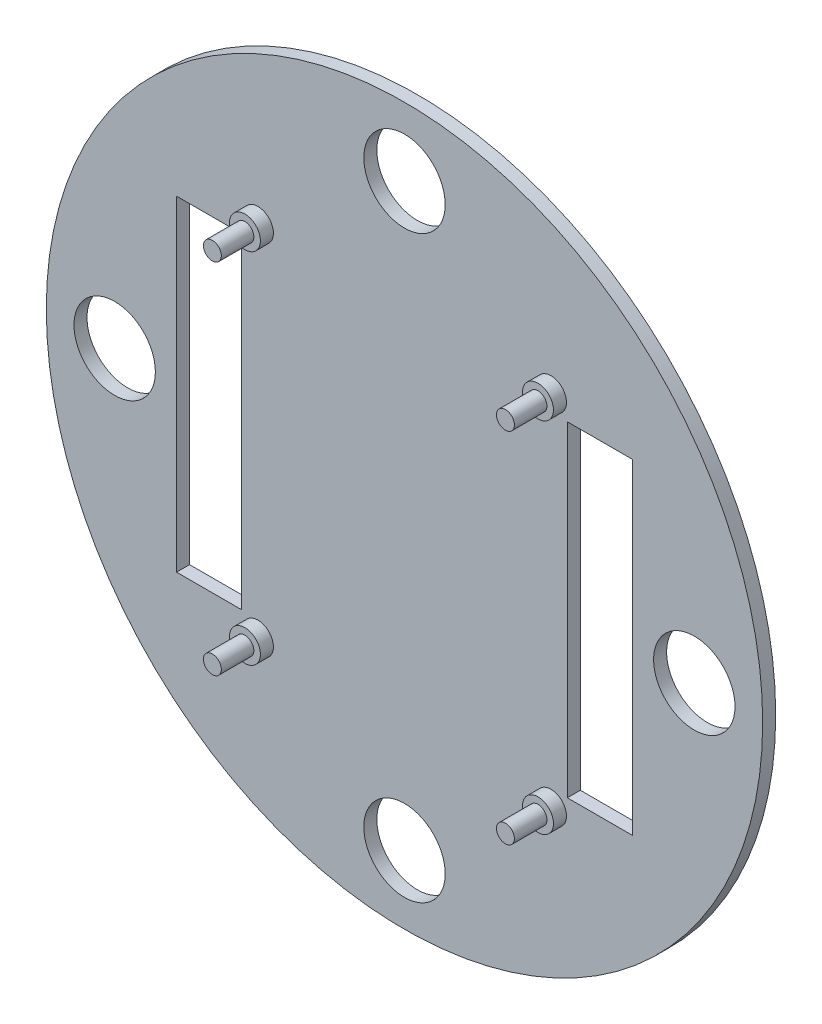
ISO-10303-21;
HEADER;
FILE_DESCRIPTION(('STEP AP214'),'2;1');
FILE_NAME('part.step','',(''),(''),'','','');
FILE_SCHEMA(('AUTOMOTIVE_DESIGN { 1 0 10303 214 1 1 1 1 }'));
ENDSEC;
DATA;
#1=APPLICATION_CONTEXT('core data for automotive mechanical design processes');
#2=APPLICATION_PROTOCOL_DEFINITION('international standard','automotive_design',2000,#1);
#3=PRODUCT_CONTEXT('',#1,'mechanical');
#4=PRODUCT('Part','Part','',(#3));
#5=PRODUCT_RELATED_PRODUCT_CATEGORY('part','',(#4));
#6=PRODUCT_DEFINITION_FORMATION('','',#4);
#7=PRODUCT_DEFINITION_CONTEXT('part definition',#1,'design');
#8=PRODUCT_DEFINITION('design','',#6,#7);
#9=PRODUCT_DEFINITION_SHAPE('','',#8);
#10=(LENGTH_UNIT() NAMED_UNIT(*) SI_UNIT(.MILLI.,.METRE.));
#11=(NAMED_UNIT(*) PLANE_ANGLE_UNIT() SI_UNIT($,.RADIAN.));
#12=(NAMED_UNIT(*) SI_UNIT($,.STERADIAN.) SOLID_ANGLE_UNIT());
#13=UNCERTAINTY_MEASURE_WITH_UNIT(LENGTH_MEASURE(1.E-05),#10,'distance_accuracy_value','');
#14=(GEOMETRIC_REPRESENTATION_CONTEXT(3) GLOBAL_UNCERTAINTY_ASSIGNED_CONTEXT((#13)) GLOBAL_UNIT_ASSIGNED_CONTEXT((#10,
#11,#12)) REPRESENTATION_CONTEXT('',''));
#15=CARTESIAN_POINT('',(0.,0.,0.));
#16=DIRECTION('',(0.,0.,1.));
#17=DIRECTION('',(1.,0.,0.));
#18=AXIS2_PLACEMENT_3D('',#15,#16,#17);
#19=CARTESIAN_POINT('',(0.,0.,0.));
#20=DIRECTION('',(0.,0.,1.));
#21=DIRECTION('',(1.,0.,0.));
#22=AXIS2_PLACEMENT_3D('',#19,#20,#21);
#23=PLANE('',#22);
#24=DIRECTION('',(-1.,0.,0.));
#25=VECTOR('',#24,1.);
#26=CARTESIAN_POINT('',(0.,25.,0.));
#27=LINE('',#26,#25);
#28=CARTESIAN_POINT('',(35.,25.,0.));
#29=VERTEX_POINT('',#28);
#30=CARTESIAN_POINT('',(25.,25.,0.));
#31=VERTEX_POINT('',#30);
#32=EDGE_CURVE('E243',#29,#31,#27,.T.);
#33=ORIENTED_EDGE('',*,*,#32,.T.);
#34=DIRECTION('',(0.,-1.,0.));
#35=VECTOR('',#34,1.);
#36=CARTESIAN_POINT('',(25.,0.,0.));
#37=LINE('',#36,#35);
#38=CARTESIAN_POINT('',(25.,-25.,0.));
#39=VERTEX_POINT('',#38);
#40=EDGE_CURVE('E247',#31,#39,#37,.T.);
#41=ORIENTED_EDGE('',*,*,#40,.T.);
#42=DIRECTION('',(1.,0.,0.));
#43=VECTOR('',#42,1.);
#44=CARTESIAN_POINT('',(0.,-25.,0.));
#45=LINE('',#44,#43);
#46=CARTESIAN_POINT('',(35.,-25.,0.));
#47=VERTEX_POINT('',#46);
#48=EDGE_CURVE('E238',#39,#47,#45,.T.);
#49=ORIENTED_EDGE('',*,*,#48,.T.);
#50=DIRECTION('',(0.,1.,0.));
#51=VECTOR('',#50,1.);
#52=CARTESIAN_POINT('',(35.,0.,0.));
#53=LINE('',#52,#51);
#54=EDGE_CURVE('E163',#47,#29,#53,.T.);
#55=ORIENTED_EDGE('',*,*,#54,.T.);
#56=EDGE_LOOP('',(#33,#41,#49,#55));
#57=FACE_BOUND('',#56,.T.);
#58=DIRECTION('',(-1.,0.,0.));
#59=VECTOR('',#58,1.);
#60=CARTESIAN_POINT('',(0.,25.,0.));
#61=LINE('',#60,#59);
#62=CARTESIAN_POINT('',(-25.,25.,0.));
#63=VERTEX_POINT('',#62);
#64=CARTESIAN_POINT('',(-35.,25.,0.));
#65=VERTEX_POINT('',#64);
#66=EDGE_CURVE('E230',#63,#65,#61,.T.);
#67=ORIENTED_EDGE('',*,*,#66,.T.);
#68=DIRECTION('',(0.,-1.,0.));
#69=VECTOR('',#68,1.);
#70=CARTESIAN_POINT('',(-35.,0.,0.));
#71=LINE('',#70,#69);
#72=CARTESIAN_POINT('',(-35.,-25.,0.));
#73=VERTEX_POINT('',#72);
#74=EDGE_CURVE('E234',#65,#73,#71,.T.);
#75=ORIENTED_EDGE('',*,*,#74,.T.);
#76=DIRECTION('',(1.,0.,0.));
#77=VECTOR('',#76,1.);
#78=CARTESIAN_POINT('',(0.,-25.,0.));
#79=LINE('',#78,#77);
#80=CARTESIAN_POINT('',(-25.,-25.,0.));
#81=VERTEX_POINT('',#80);
#82=EDGE_CURVE('E192',#73,#81,#79,.T.);
#83=ORIENTED_EDGE('',*,*,#82,.T.);
#84=DIRECTION('',(0.,1.,0.));
#85=VECTOR('',#84,1.);
#86=CARTESIAN_POINT('',(-25.,0.,0.));
#87=LINE('',#86,#85);
#88=EDGE_CURVE('E226',#81,#63,#87,.T.);
#89=ORIENTED_EDGE('',*,*,#88,.T.);
#90=EDGE_LOOP('',(#67,#75,#83,#89));
#91=FACE_BOUND('',#90,.T.);
#92=CARTESIAN_POINT('',(44.5,0.,0.));
#93=DIRECTION('',(0.,0.,1.));
#94=DIRECTION('',(1.,0.,0.));
#95=AXIS2_PLACEMENT_3D('',#92,#93,#94);
#96=CIRCLE('',#95,6.25);
#97=CARTESIAN_POINT('',(50.75,0.,0.));
#98=VERTEX_POINT('',#97);
#99=EDGE_CURVE('E252',#98,#98,#96,.T.);
#100=ORIENTED_EDGE('',*,*,#99,.T.);
#101=EDGE_LOOP('',(#100));
#102=FACE_BOUND('',#101,.T.);
#103=CARTESIAN_POINT('',(0.,44.5,0.));
#104=DIRECTION('',(0.,0.,1.));
#105=DIRECTION('',(1.,0.,0.));
#106=AXIS2_PLACEMENT_3D('',#103,#104,#105);
#107=CIRCLE('',#106,6.25);
#108=CARTESIAN_POINT('',(6.25,44.5,0.));
#109=VERTEX_POINT('',#108);
#110=EDGE_CURVE('E265',#109,#109,#107,.T.);
#111=ORIENTED_EDGE('',*,*,#110,.T.);
#112=EDGE_LOOP('',(#111));
#113=FACE_BOUND('',#112,.T.);
#114=CARTESIAN_POINT('',(-44.5,0.,0.));
#115=DIRECTION('',(0.,0.,1.));
#116=DIRECTION('',(1.,0.,0.));
#117=AXIS2_PLACEMENT_3D('',#114,#115,#116);
#118=CIRCLE('',#117,6.25);
#119=CARTESIAN_POINT('',(-38.25,0.,0.));
#120=VERTEX_POINT('',#119);
#121=EDGE_CURVE('E273',#120,#120,#118,.T.);
#122=ORIENTED_EDGE('',*,*,#121,.T.);
#123=EDGE_LOOP('',(#122));
#124=FACE_BOUND('',#123,.T.);
#125=CARTESIAN_POINT('',(0.,-44.5,0.));
#126=DIRECTION('',(0.,0.,1.));
#127=DIRECTION('',(1.,0.,0.));
#128=AXIS2_PLACEMENT_3D('',#125,#126,#127);
#129=CIRCLE('',#128,6.25);
#130=CARTESIAN_POINT('',(6.25,-44.5,0.));
#131=VERTEX_POINT('',#130);
#132=EDGE_CURVE('E251',#131,#131,#129,.T.);
#133=ORIENTED_EDGE('',*,*,#132,.T.);
#134=EDGE_LOOP('',(#133));
#135=FACE_BOUND('',#134,.T.);
#136=CARTESIAN_POINT('',(0.,0.,0.));
#137=DIRECTION('',(0.,0.,1.));
#138=DIRECTION('',(1.,0.,0.));
#139=AXIS2_PLACEMENT_3D('',#136,#137,#138);
#140=CIRCLE('',#139,55.);
#141=CARTESIAN_POINT('',(55.,0.,0.));
#142=VERTEX_POINT('',#141);
#143=EDGE_CURVE('E287',#142,#142,#140,.F.);
#144=ORIENTED_EDGE('',*,*,#143,.T.);
#145=EDGE_LOOP('',(#144));
#146=FACE_BOUND('',#145,.T.);
#147=ADVANCED_FACE('F91',(#57,#91,#102,#113,#124,#135,#146),#23,.F.);
#148=CARTESIAN_POINT('',(0.,0.,2.));
#149=DIRECTION('',(0.,0.,1.));
#150=DIRECTION('',(1.,0.,0.));
#151=AXIS2_PLACEMENT_3D('',#148,#149,#150);
#152=PLANE('',#151);
#153=DIRECTION('',(0.,-1.,0.));
#154=VECTOR('',#153,1.);
#155=CARTESIAN_POINT('',(25.,25.,2.));
#156=LINE('',#155,#154);
#157=CARTESIAN_POINT('',(25.,25.,2.));
#158=VERTEX_POINT('',#157);
#159=CARTESIAN_POINT('',(25.,-25.,2.));
#160=VERTEX_POINT('',#159);
#161=EDGE_CURVE('E177',#158,#160,#156,.T.);
#162=ORIENTED_EDGE('',*,*,#161,.F.);
#163=DIRECTION('',(-1.,0.,0.));
#164=VECTOR('',#163,1.);
#165=CARTESIAN_POINT('',(25.,25.,2.));
#166=LINE('',#165,#164);
#167=CARTESIAN_POINT('',(35.,25.,2.));
#168=VERTEX_POINT('',#167);
#169=EDGE_CURVE('E182',#168,#158,#166,.T.);
#170=ORIENTED_EDGE('',*,*,#169,.F.);
#171=DIRECTION('',(0.,1.,0.));
#172=VECTOR('',#171,1.);
#173=CARTESIAN_POINT('',(35.,25.,2.));
#174=LINE('',#173,#172);
#175=CARTESIAN_POINT('',(35.,-25.,2.));
#176=VERTEX_POINT('',#175);
#177=EDGE_CURVE('E160',#176,#168,#174,.T.);
#178=ORIENTED_EDGE('',*,*,#177,.F.);
#179=DIRECTION('',(1.,0.,0.));
#180=VECTOR('',#179,1.);
#181=CARTESIAN_POINT('',(25.,-25.,2.));
#182=LINE('',#181,#180);
#183=EDGE_CURVE('E171',#160,#176,#182,.T.);
#184=ORIENTED_EDGE('',*,*,#183,.F.);
#185=EDGE_LOOP('',(#162,#170,#178,#184));
#186=FACE_BOUND('',#185,.T.);
#187=DIRECTION('',(0.,-1.,0.));
#188=VECTOR('',#187,1.);
#189=CARTESIAN_POINT('',(-35.,25.,2.));
#190=LINE('',#189,#188);
#191=CARTESIAN_POINT('',(-35.,25.,2.));
#192=VERTEX_POINT('',#191);
#193=CARTESIAN_POINT('',(-35.,-25.,2.));
#194=VERTEX_POINT('',#193);
#195=EDGE_CURVE('E197',#192,#194,#190,.T.);
#196=ORIENTED_EDGE('',*,*,#195,.F.);
#197=DIRECTION('',(-1.,0.,0.));
#198=VECTOR('',#197,1.);
#199=CARTESIAN_POINT('',(-35.,25.,2.));
#200=LINE('',#199,#198);
#201=CARTESIAN_POINT('',(-25.,25.,2.));
#202=VERTEX_POINT('',#201);
#203=EDGE_CURVE('E207',#202,#192,#200,.T.);
#204=ORIENTED_EDGE('',*,*,#203,.F.);
#205=DIRECTION('',(0.,1.,0.));
#206=VECTOR('',#205,1.);
#207=CARTESIAN_POINT('',(-25.,25.,2.));
#208=LINE('',#207,#206);
#209=CARTESIAN_POINT('',(-25.,-25.,2.));
#210=VERTEX_POINT('',#209);
#211=EDGE_CURVE('E203',#210,#202,#208,.T.);
#212=ORIENTED_EDGE('',*,*,#211,.F.);
#213=DIRECTION('',(1.,0.,0.));
#214=VECTOR('',#213,1.);
#215=CARTESIAN_POINT('',(-35.,-25.,2.));
#216=LINE('',#215,#214);
#217=EDGE_CURVE('E200',#194,#210,#216,.T.);
#218=ORIENTED_EDGE('',*,*,#217,.F.);
#219=EDGE_LOOP('',(#196,#204,#212,#218));
#220=FACE_BOUND('',#219,.T.);
#221=CARTESIAN_POINT('',(44.5,0.,2.));
#222=DIRECTION('',(0.,0.,1.));
#223=DIRECTION('',(1.,0.,0.));
#224=AXIS2_PLACEMENT_3D('',#221,#222,#223);
#225=CIRCLE('',#224,6.25);
#226=CARTESIAN_POINT('',(50.75,0.,2.));
#227=VERTEX_POINT('',#226);
#228=EDGE_CURVE('E257',#227,#227,#225,.T.);
#229=ORIENTED_EDGE('',*,*,#228,.F.);
#230=EDGE_LOOP('',(#229));
#231=FACE_BOUND('',#230,.T.);
#232=CARTESIAN_POINT('',(0.,44.5,2.));
#233=DIRECTION('',(0.,0.,1.));
#234=DIRECTION('',(1.,0.,0.));
#235=AXIS2_PLACEMENT_3D('',#232,#233,#234);
#236=CIRCLE('',#235,6.25);
#237=CARTESIAN_POINT('',(6.25,44.5,2.));
#238=VERTEX_POINT('',#237);
#239=EDGE_CURVE('E261',#238,#238,#236,.T.);
#240=ORIENTED_EDGE('',*,*,#239,.F.);
#241=EDGE_LOOP('',(#240));
#242=FACE_BOUND('',#241,.T.);
#243=CARTESIAN_POINT('',(-44.5,0.,2.));
#244=DIRECTION('',(0.,0.,1.));
#245=DIRECTION('',(1.,0.,0.));
#246=AXIS2_PLACEMENT_3D('',#243,#244,#245);
#247=CIRCLE('',#246,6.25);
#248=CARTESIAN_POINT('',(-38.25,0.,2.));
#249=VERTEX_POINT('',#248);
#250=EDGE_CURVE('E269',#249,#249,#247,.T.);
#251=ORIENTED_EDGE('',*,*,#250,.F.);
#252=EDGE_LOOP('',(#251));
#253=FACE_BOUND('',#252,.T.);
#254=CARTESIAN_POINT('',(0.,-44.5,2.));
#255=DIRECTION('',(0.,0.,1.));
#256=DIRECTION('',(1.,0.,0.));
#257=AXIS2_PLACEMENT_3D('',#254,#255,#256);
#258=CIRCLE('',#257,6.25);
#259=CARTESIAN_POINT('',(6.25,-44.5,2.));
#260=VERTEX_POINT('',#259);
#261=EDGE_CURVE('E277',#260,#260,#258,.T.);
#262=ORIENTED_EDGE('',*,*,#261,.F.);
#263=EDGE_LOOP('',(#262));
#264=FACE_BOUND('',#263,.T.);
#265=CARTESIAN_POINT('',(22.5,-27.5,2.));
#266=DIRECTION('',(0.,0.,1.));
#267=DIRECTION('',(1.,0.,0.));
#268=AXIS2_PLACEMENT_3D('',#265,#266,#267);
#269=CIRCLE('',#268,2.37500000000001);
#270=CARTESIAN_POINT('',(24.875,-27.5,2.));
#271=VERTEX_POINT('',#270);
#272=EDGE_CURVE('E291',#271,#271,#269,.T.);
#273=ORIENTED_EDGE('',*,*,#272,.F.);
#274=EDGE_LOOP('',(#273));
#275=FACE_BOUND('',#274,.T.);
#276=CARTESIAN_POINT('',(-22.5,-27.5,2.));
#277=DIRECTION('',(0.,0.,1.));
#278=DIRECTION('',(1.,0.,0.));
#279=AXIS2_PLACEMENT_3D('',#276,#277,#278);
#280=CIRCLE('',#279,2.375);
#281=CARTESIAN_POINT('',(-20.125,-27.5,2.));
#282=VERTEX_POINT('',#281);
#283=EDGE_CURVE('E304',#282,#282,#280,.T.);
#284=ORIENTED_EDGE('',*,*,#283,.F.);
#285=EDGE_LOOP('',(#284));
#286=FACE_BOUND('',#285,.T.);
#287=CARTESIAN_POINT('',(-22.5,27.5,2.));
#288=DIRECTION('',(0.,0.,1.));
#289=DIRECTION('',(1.,0.,0.));
#290=AXIS2_PLACEMENT_3D('',#287,#288,#289);
#291=CIRCLE('',#290,2.375);
#292=CARTESIAN_POINT('',(-20.125,27.5,2.));
#293=VERTEX_POINT('',#292);
#294=EDGE_CURVE('E313',#293,#293,#291,.T.);
#295=ORIENTED_EDGE('',*,*,#294,.F.);
#296=EDGE_LOOP('',(#295));
#297=FACE_BOUND('',#296,.T.);
#298=CARTESIAN_POINT('',(22.5,27.5,2.));
#299=DIRECTION('',(0.,0.,1.));
#300=DIRECTION('',(1.,0.,0.));
#301=AXIS2_PLACEMENT_3D('',#298,#299,#300);
#302=CIRCLE('',#301,2.37500000000001);
#303=CARTESIAN_POINT('',(24.875,27.5,2.));
#304=VERTEX_POINT('',#303);
#305=EDGE_CURVE('E322',#304,#304,#302,.T.);
#306=ORIENTED_EDGE('',*,*,#305,.F.);
#307=EDGE_LOOP('',(#306));
#308=FACE_BOUND('',#307,.T.);
#309=CARTESIAN_POINT('',(0.,0.,2.));
#310=DIRECTION('',(0.,0.,-1.));
#311=DIRECTION('',(1.,0.,0.));
#312=AXIS2_PLACEMENT_3D('',#309,#310,#311);
#313=CIRCLE('',#312,55.);
#314=CARTESIAN_POINT('',(55.,0.,2.));
#315=VERTEX_POINT('',#314);
#316=EDGE_CURVE('E256',#315,#315,#313,.T.);
#317=ORIENTED_EDGE('',*,*,#316,.F.);
#318=EDGE_LOOP('',(#317));
#319=FACE_BOUND('',#318,.T.);
#320=ADVANCED_FACE('F179',(#186,#220,#231,#242,#253,#264,#275,#286,#297,#308,#319),#152,.T.);
#321=CARTESIAN_POINT('',(22.5,27.5,4.));
#322=DIRECTION('',(0.,0.,-1.));
#323=DIRECTION('',(-1.,0.,0.));
#324=AXIS2_PLACEMENT_3D('',#321,#322,#323);
#325=CYLINDRICAL_SURFACE('',#324,2.37500000000001);
#326=CARTESIAN_POINT('',(22.5,27.5,4.));
#327=DIRECTION('',(0.,0.,1.));
#328=DIRECTION('',(1.,0.,0.));
#329=AXIS2_PLACEMENT_3D('',#326,#327,#328);
#330=CIRCLE('',#329,2.37500000000001);
#331=CARTESIAN_POINT('',(24.875,27.5,4.));
#332=VERTEX_POINT('',#331);
#333=EDGE_CURVE('E317',#332,#332,#330,.T.);
#334=ORIENTED_EDGE('',*,*,#333,.F.);
#335=EDGE_LOOP('',(#334));
#336=FACE_BOUND('',#335,.T.);
#337=ORIENTED_EDGE('',*,*,#305,.T.);
#338=EDGE_LOOP('',(#337));
#339=FACE_BOUND('',#338,.T.);
#340=ADVANCED_FACE('F365',(#336,#339),#325,.T.);
#341=CARTESIAN_POINT('',(22.5,27.5,4.));
#342=DIRECTION('',(0.,0.,1.));
#343=DIRECTION('',(1.,0.,0.));
#344=AXIS2_PLACEMENT_3D('',#341,#342,#343);
#345=PLANE('',#344);
#346=CARTESIAN_POINT('',(22.5,27.5,4.));
#347=DIRECTION('',(0.,0.,1.));
#348=DIRECTION('',(1.,0.,0.));
#349=AXIS2_PLACEMENT_3D('',#346,#347,#348);
#350=CIRCLE('',#349,1.375);
#351=CARTESIAN_POINT('',(23.875,27.5,4.));
#352=VERTEX_POINT('',#351);
#353=EDGE_CURVE('E321',#352,#352,#350,.T.);
#354=ORIENTED_EDGE('',*,*,#353,.F.);
#355=EDGE_LOOP('',(#354));
#356=FACE_BOUND('',#355,.T.);
#357=ORIENTED_EDGE('',*,*,#333,.T.);
#358=EDGE_LOOP('',(#357));
#359=FACE_BOUND('',#358,.T.);
#360=ADVANCED_FACE('F428',(#356,#359),#345,.T.);
#361=CARTESIAN_POINT('',(22.5,27.5,9.));
#362=DIRECTION('',(0.,0.,1.));
#363=DIRECTION('',(1.,0.,0.));
#364=AXIS2_PLACEMENT_3D('',#361,#362,#363);
#365=PLANE('',#364);
#366=CARTESIAN_POINT('',(22.5,27.5,9.));
#367=DIRECTION('',(0.,0.,1.));
#368=DIRECTION('',(1.,0.,0.));
#369=AXIS2_PLACEMENT_3D('',#366,#367,#368);
#370=CIRCLE('',#369,1.375);
#371=CARTESIAN_POINT('',(23.875,27.5,9.));
#372=VERTEX_POINT('',#371);
#373=EDGE_CURVE('E330',#372,#372,#370,.T.);
#374=ORIENTED_EDGE('',*,*,#373,.T.);
#375=EDGE_LOOP('',(#374));
#376=FACE_BOUND('',#375,.T.);
#377=ADVANCED_FACE('F431',(#376),#365,.T.);
#378=CARTESIAN_POINT('',(22.5,27.5,9.));
#379=DIRECTION('',(0.,0.,-1.));
#380=DIRECTION('',(-1.,0.,0.));
#381=AXIS2_PLACEMENT_3D('',#378,#379,#380);
#382=CYLINDRICAL_SURFACE('',#381,1.375);
#383=ORIENTED_EDGE('',*,*,#353,.T.);
#384=EDGE_LOOP('',(#383));
#385=FACE_BOUND('',#384,.T.);
#386=ORIENTED_EDGE('',*,*,#373,.F.);
#387=EDGE_LOOP('',(#386));
#388=FACE_BOUND('',#387,.T.);
#389=ADVANCED_FACE('F426',(#385,#388),#382,.T.);
#390=CARTESIAN_POINT('',(-22.5,27.5,4.));
#391=DIRECTION('',(0.,0.,-1.));
#392=DIRECTION('',(-1.,0.,0.));
#393=AXIS2_PLACEMENT_3D('',#390,#391,#392);
#394=CYLINDRICAL_SURFACE('',#393,2.375);
#395=CARTESIAN_POINT('',(-22.5,27.5,4.));
#396=DIRECTION('',(0.,0.,1.));
#397=DIRECTION('',(1.,0.,0.));
#398=AXIS2_PLACEMENT_3D('',#395,#396,#397);
#399=CIRCLE('',#398,2.375);
#400=CARTESIAN_POINT('',(-20.125,27.5,4.));
#401=VERTEX_POINT('',#400);
#402=EDGE_CURVE('E308',#401,#401,#399,.T.);
#403=ORIENTED_EDGE('',*,*,#402,.F.);
#404=EDGE_LOOP('',(#403));
#405=FACE_BOUND('',#404,.T.);
#406=ORIENTED_EDGE('',*,*,#294,.T.);
#407=EDGE_LOOP('',(#406));
#408=FACE_BOUND('',#407,.T.);
#409=ADVANCED_FACE('F422',(#405,#408),#394,.T.);
#410=CARTESIAN_POINT('',(-22.5,27.5,4.));
#411=DIRECTION('',(0.,0.,1.));
#412=DIRECTION('',(1.,0.,0.));
#413=AXIS2_PLACEMENT_3D('',#410,#411,#412);
#414=PLANE('',#413);
#415=CARTESIAN_POINT('',(-22.5,27.5,4.));
#416=DIRECTION('',(0.,0.,1.));
#417=DIRECTION('',(1.,0.,0.));
#418=AXIS2_PLACEMENT_3D('',#415,#416,#417);
#419=CIRCLE('',#418,1.375);
#420=CARTESIAN_POINT('',(-21.125,27.5,4.));
#421=VERTEX_POINT('',#420);
#422=EDGE_CURVE('E312',#421,#421,#419,.T.);
#423=ORIENTED_EDGE('',*,*,#422,.F.);
#424=EDGE_LOOP('',(#423));
#425=FACE_BOUND('',#424,.T.);
#426=ORIENTED_EDGE('',*,*,#402,.T.);
#427=EDGE_LOOP('',(#426));
#428=FACE_BOUND('',#427,.T.);
#429=ADVANCED_FACE('F418',(#425,#428),#414,.T.);
#430=CARTESIAN_POINT('',(-22.5,27.5,9.));
#431=DIRECTION('',(0.,0.,1.));
#432=DIRECTION('',(1.,0.,0.));
#433=AXIS2_PLACEMENT_3D('',#430,#431,#432);
#434=PLANE('',#433);
#435=CARTESIAN_POINT('',(-22.5,27.5,9.));
#436=DIRECTION('',(0.,0.,1.));
#437=DIRECTION('',(1.,0.,0.));
#438=AXIS2_PLACEMENT_3D('',#435,#436,#437);
#439=CIRCLE('',#438,1.375);
#440=CARTESIAN_POINT('',(-21.125,27.5,9.));
#441=VERTEX_POINT('',#440);
#442=EDGE_CURVE('E326',#441,#441,#439,.T.);
#443=ORIENTED_EDGE('',*,*,#442,.T.);
#444=EDGE_LOOP('',(#443));
#445=FACE_BOUND('',#444,.T.);
#446=ADVANCED_FACE('F421',(#445),#434,.T.);
#447=CARTESIAN_POINT('',(-22.5,27.5,9.));
#448=DIRECTION('',(0.,0.,-1.));
#449=DIRECTION('',(-1.,0.,0.));
#450=AXIS2_PLACEMENT_3D('',#447,#448,#449);
#451=CYLINDRICAL_SURFACE('',#450,1.375);
#452=ORIENTED_EDGE('',*,*,#422,.T.);
#453=EDGE_LOOP('',(#452));
#454=FACE_BOUND('',#453,.T.);
#455=ORIENTED_EDGE('',*,*,#442,.F.);
#456=EDGE_LOOP('',(#455));
#457=FACE_BOUND('',#456,.T.);
#458=ADVANCED_FACE('F359',(#454,#457),#451,.T.);
#459=CARTESIAN_POINT('',(-22.5,-27.5,4.));
#460=DIRECTION('',(0.,0.,-1.));
#461=DIRECTION('',(-1.,0.,0.));
#462=AXIS2_PLACEMENT_3D('',#459,#460,#461);
#463=CYLINDRICAL_SURFACE('',#462,2.375);
#464=CARTESIAN_POINT('',(-22.5,-27.5,4.));
#465=DIRECTION('',(0.,0.,1.));
#466=DIRECTION('',(1.,0.,0.));
#467=AXIS2_PLACEMENT_3D('',#464,#465,#466);
#468=CIRCLE('',#467,2.375);
#469=CARTESIAN_POINT('',(-20.125,-27.5,4.));
#470=VERTEX_POINT('',#469);
#471=EDGE_CURVE('E299',#470,#470,#468,.T.);
#472=ORIENTED_EDGE('',*,*,#471,.F.);
#473=EDGE_LOOP('',(#472));
#474=FACE_BOUND('',#473,.T.);
#475=ORIENTED_EDGE('',*,*,#283,.T.);
#476=EDGE_LOOP('',(#475));
#477=FACE_BOUND('',#476,.T.);
#478=ADVANCED_FACE('F353',(#474,#477),#463,.T.);
#479=CARTESIAN_POINT('',(-22.5,-27.5,4.));
#480=DIRECTION('',(0.,0.,1.));
#481=DIRECTION('',(1.,0.,0.));
#482=AXIS2_PLACEMENT_3D('',#479,#480,#481);
#483=PLANE('',#482);
#484=CARTESIAN_POINT('',(-22.5,-27.5,4.));
#485=DIRECTION('',(0.,0.,1.));
#486=DIRECTION('',(1.,0.,0.));
#487=AXIS2_PLACEMENT_3D('',#484,#485,#486);
#488=CIRCLE('',#487,1.375);
#489=CARTESIAN_POINT('',(-21.125,-27.5,4.));
#490=VERTEX_POINT('',#489);
#491=EDGE_CURVE('E303',#490,#490,#488,.T.);
#492=ORIENTED_EDGE('',*,*,#491,.F.);
#493=EDGE_LOOP('',(#492));
#494=FACE_BOUND('',#493,.T.);
#495=ORIENTED_EDGE('',*,*,#471,.T.);
#496=EDGE_LOOP('',(#495));
#497=FACE_BOUND('',#496,.T.);
#498=ADVANCED_FACE('F349',(#494,#497),#483,.T.);
#499=CARTESIAN_POINT('',(-22.5,-27.5,9.));
#500=DIRECTION('',(0.,0.,1.));
#501=DIRECTION('',(1.,0.,0.));
#502=AXIS2_PLACEMENT_3D('',#499,#500,#501);
#503=PLANE('',#502);
#504=CARTESIAN_POINT('',(-22.5,-27.5,9.));
#505=DIRECTION('',(0.,0.,1.));
#506=DIRECTION('',(1.,0.,0.));
#507=AXIS2_PLACEMENT_3D('',#504,#505,#506);
#508=CIRCLE('',#507,1.375);
#509=CARTESIAN_POINT('',(-21.125,-27.5,9.));
#510=VERTEX_POINT('',#509);
#511=EDGE_CURVE('E12',#510,#510,#508,.T.);
#512=ORIENTED_EDGE('',*,*,#511,.T.);
#513=EDGE_LOOP('',(#512));
#514=FACE_BOUND('',#513,.T.);
#515=ADVANCED_FACE('F352',(#514),#503,.T.);
#516=CARTESIAN_POINT('',(-22.5,-27.5,9.));
#517=DIRECTION('',(0.,0.,-1.));
#518=DIRECTION('',(-1.,0.,0.));
#519=AXIS2_PLACEMENT_3D('',#516,#517,#518);
#520=CYLINDRICAL_SURFACE('',#519,1.375);
#521=ORIENTED_EDGE('',*,*,#491,.T.);
#522=EDGE_LOOP('',(#521));
#523=FACE_BOUND('',#522,.T.);
#524=ORIENTED_EDGE('',*,*,#511,.F.);
#525=EDGE_LOOP('',(#524));
#526=FACE_BOUND('',#525,.T.);
#527=ADVANCED_FACE('F346',(#523,#526),#520,.T.);
#528=CARTESIAN_POINT('',(22.5,-27.5,4.));
#529=DIRECTION('',(0.,0.,-1.));
#530=DIRECTION('',(-1.,0.,0.));
#531=AXIS2_PLACEMENT_3D('',#528,#529,#530);
#532=CYLINDRICAL_SURFACE('',#531,2.37500000000001);
#533=CARTESIAN_POINT('',(22.5,-27.5,4.));
#534=DIRECTION('',(0.,0.,1.));
#535=DIRECTION('',(1.,0.,0.));
#536=AXIS2_PLACEMENT_3D('',#533,#534,#535);
#537=CIRCLE('',#536,2.37500000000001);
#538=CARTESIAN_POINT('',(24.875,-27.5,4.));
#539=VERTEX_POINT('',#538);
#540=EDGE_CURVE('E292',#539,#539,#537,.T.);
#541=ORIENTED_EDGE('',*,*,#540,.F.);
#542=EDGE_LOOP('',(#541));
#543=FACE_BOUND('',#542,.T.);
#544=ORIENTED_EDGE('',*,*,#272,.T.);
#545=EDGE_LOOP('',(#544));
#546=FACE_BOUND('',#545,.T.);
#547=ADVANCED_FACE('F403',(#543,#546),#532,.T.);
#548=CARTESIAN_POINT('',(22.5,-27.5,4.));
#549=DIRECTION('',(0.,0.,1.));
#550=DIRECTION('',(1.,0.,0.));
#551=AXIS2_PLACEMENT_3D('',#548,#549,#550);
#552=PLANE('',#551);
#553=CARTESIAN_POINT('',(22.5,-27.5,4.));
#554=DIRECTION('',(0.,0.,1.));
#555=DIRECTION('',(1.,0.,0.));
#556=AXIS2_PLACEMENT_3D('',#553,#554,#555);
#557=CIRCLE('',#556,1.375);
#558=CARTESIAN_POINT('',(23.875,-27.5,4.));
#559=VERTEX_POINT('',#558);
#560=EDGE_CURVE('E94',#559,#559,#557,.T.);
#561=ORIENTED_EDGE('',*,*,#560,.F.);
#562=EDGE_LOOP('',(#561));
#563=FACE_BOUND('',#562,.T.);
#564=ORIENTED_EDGE('',*,*,#540,.T.);
#565=EDGE_LOOP('',(#564));
#566=FACE_BOUND('',#565,.T.);
#567=ADVANCED_FACE('F405',(#563,#566),#552,.T.);
#568=CARTESIAN_POINT('',(22.5,-27.5,9.));
#569=DIRECTION('',(0.,0.,1.));
#570=DIRECTION('',(1.,0.,0.));
#571=AXIS2_PLACEMENT_3D('',#568,#569,#570);
#572=PLANE('',#571);
#573=CARTESIAN_POINT('',(22.5,-27.5,9.));
#574=DIRECTION('',(0.,0.,1.));
#575=DIRECTION('',(1.,0.,0.));
#576=AXIS2_PLACEMENT_3D('',#573,#574,#575);
#577=CIRCLE('',#576,1.375);
#578=CARTESIAN_POINT('',(23.875,-27.5,9.));
#579=VERTEX_POINT('',#578);
#580=EDGE_CURVE('E100',#579,#579,#577,.T.);
#581=ORIENTED_EDGE('',*,*,#580,.T.);
#582=EDGE_LOOP('',(#581));
#583=FACE_BOUND('',#582,.T.);
#584=ADVANCED_FACE('F412',(#583),#572,.T.);
#585=CARTESIAN_POINT('',(22.5,-27.5,9.));
#586=DIRECTION('',(0.,0.,-1.));
#587=DIRECTION('',(-1.,0.,0.));
#588=AXIS2_PLACEMENT_3D('',#585,#586,#587);
#589=CYLINDRICAL_SURFACE('',#588,1.375);
#590=ORIENTED_EDGE('',*,*,#560,.T.);
#591=EDGE_LOOP('',(#590));
#592=FACE_BOUND('',#591,.T.);
#593=ORIENTED_EDGE('',*,*,#580,.F.);
#594=EDGE_LOOP('',(#593));
#595=FACE_BOUND('',#594,.T.);
#596=ADVANCED_FACE('F376',(#592,#595),#589,.T.);
#597=CARTESIAN_POINT('',(0.,0.,-49.9999999999996));
#598=DIRECTION('',(0.,0.,1.));
#599=DIRECTION('',(1.,0.,0.));
#600=AXIS2_PLACEMENT_3D('',#597,#598,#599);
#601=CYLINDRICAL_SURFACE('',#600,55.);
#602=ORIENTED_EDGE('',*,*,#316,.T.);
#603=EDGE_LOOP('',(#602));
#604=FACE_BOUND('',#603,.T.);
#605=ORIENTED_EDGE('',*,*,#143,.F.);
#606=EDGE_LOOP('',(#605));
#607=FACE_BOUND('',#606,.T.);
#608=ADVANCED_FACE('F372',(#604,#607),#601,.T.);
#609=CARTESIAN_POINT('',(0.,-44.5,0.));
#610=DIRECTION('',(0.,0.,1.));
#611=DIRECTION('',(1.,0.,0.));
#612=AXIS2_PLACEMENT_3D('',#609,#610,#611);
#613=CYLINDRICAL_SURFACE('',#612,6.25);
#614=ORIENTED_EDGE('',*,*,#132,.F.);
#615=EDGE_LOOP('',(#614));
#616=FACE_BOUND('',#615,.T.);
#617=ORIENTED_EDGE('',*,*,#261,.T.);
#618=EDGE_LOOP('',(#617));
#619=FACE_BOUND('',#618,.T.);
#620=ADVANCED_FACE('F375',(#616,#619),#613,.F.);
#621=CARTESIAN_POINT('',(-44.5,0.,0.));
#622=DIRECTION('',(0.,0.,1.));
#623=DIRECTION('',(1.,0.,0.));
#624=AXIS2_PLACEMENT_3D('',#621,#622,#623);
#625=CYLINDRICAL_SURFACE('',#624,6.25);
#626=ORIENTED_EDGE('',*,*,#121,.F.);
#627=EDGE_LOOP('',(#626));
#628=FACE_BOUND('',#627,.T.);
#629=ORIENTED_EDGE('',*,*,#250,.T.);
#630=EDGE_LOOP('',(#629));
#631=FACE_BOUND('',#630,.T.);
#632=ADVANCED_FACE('F396',(#628,#631),#625,.F.);
#633=CARTESIAN_POINT('',(0.,44.5,0.));
#634=DIRECTION('',(0.,0.,1.));
#635=DIRECTION('',(1.,0.,0.));
#636=AXIS2_PLACEMENT_3D('',#633,#634,#635);
#637=CYLINDRICAL_SURFACE('',#636,6.25);
#638=ORIENTED_EDGE('',*,*,#110,.F.);
#639=EDGE_LOOP('',(#638));
#640=FACE_BOUND('',#639,.T.);
#641=ORIENTED_EDGE('',*,*,#239,.T.);
#642=EDGE_LOOP('',(#641));
#643=FACE_BOUND('',#642,.T.);
#644=ADVANCED_FACE('F511',(#640,#643),#637,.F.);
#645=CARTESIAN_POINT('',(44.5,0.,0.));
#646=DIRECTION('',(0.,0.,1.));
#647=DIRECTION('',(1.,0.,0.));
#648=AXIS2_PLACEMENT_3D('',#645,#646,#647);
#649=CYLINDRICAL_SURFACE('',#648,6.25);
#650=ORIENTED_EDGE('',*,*,#99,.F.);
#651=EDGE_LOOP('',(#650));
#652=FACE_BOUND('',#651,.T.);
#653=ORIENTED_EDGE('',*,*,#228,.T.);
#654=EDGE_LOOP('',(#653));
#655=FACE_BOUND('',#654,.T.);
#656=ADVANCED_FACE('F521',(#652,#655),#649,.F.);
#657=CARTESIAN_POINT('',(-35.,25.,-1.));
#658=DIRECTION('',(-1.,0.,0.));
#659=DIRECTION('',(0.,-1.,0.));
#660=AXIS2_PLACEMENT_3D('',#657,#658,#659);
#661=PLANE('',#660);
#662=DIRECTION('',(0.,0.,1.));
#663=VECTOR('',#662,1.);
#664=CARTESIAN_POINT('',(-35.,25.,-1.));
#665=LINE('',#664,#663);
#666=EDGE_CURVE('E212',#65,#192,#665,.T.);
#667=ORIENTED_EDGE('',*,*,#666,.T.);
#668=ORIENTED_EDGE('',*,*,#195,.T.);
#669=DIRECTION('',(0.,0.,1.));
#670=VECTOR('',#669,1.);
#671=CARTESIAN_POINT('',(-35.,-25.,-1.));
#672=LINE('',#671,#670);
#673=EDGE_CURVE('E211',#73,#194,#672,.T.);
#674=ORIENTED_EDGE('',*,*,#673,.F.);
#675=ORIENTED_EDGE('',*,*,#74,.F.);
#676=EDGE_LOOP('',(#667,#668,#674,#675));
#677=FACE_BOUND('',#676,.T.);
#678=ADVANCED_FACE('F530',(#677),#661,.F.);
#679=CARTESIAN_POINT('',(-35.,25.,-1.));
#680=DIRECTION('',(0.,1.,0.));
#681=DIRECTION('',(-1.,0.,0.));
#682=AXIS2_PLACEMENT_3D('',#679,#680,#681);
#683=PLANE('',#682);
#684=DIRECTION('',(0.,0.,1.));
#685=VECTOR('',#684,1.);
#686=CARTESIAN_POINT('',(-25.,25.,-1.));
#687=LINE('',#686,#685);
#688=EDGE_CURVE('E215',#63,#202,#687,.T.);
#689=ORIENTED_EDGE('',*,*,#688,.T.);
#690=ORIENTED_EDGE('',*,*,#203,.T.);
#691=ORIENTED_EDGE('',*,*,#666,.F.);
#692=ORIENTED_EDGE('',*,*,#66,.F.);
#693=EDGE_LOOP('',(#689,#690,#691,#692));
#694=FACE_BOUND('',#693,.T.);
#695=ADVANCED_FACE('F551',(#694),#683,.F.);
#696=CARTESIAN_POINT('',(-25.,25.,-1.));
#697=DIRECTION('',(1.,0.,0.));
#698=DIRECTION('',(0.,1.,0.));
#699=AXIS2_PLACEMENT_3D('',#696,#697,#698);
#700=PLANE('',#699);
#701=DIRECTION('',(0.,0.,1.));
#702=VECTOR('',#701,1.);
#703=CARTESIAN_POINT('',(-25.,-25.,-1.));
#704=LINE('',#703,#702);
#705=EDGE_CURVE('E116',#81,#210,#704,.T.);
#706=ORIENTED_EDGE('',*,*,#705,.T.);
#707=ORIENTED_EDGE('',*,*,#211,.T.);
#708=ORIENTED_EDGE('',*,*,#688,.F.);
#709=ORIENTED_EDGE('',*,*,#88,.F.);
#710=EDGE_LOOP('',(#706,#707,#708,#709));
#711=FACE_BOUND('',#710,.T.);
#712=ADVANCED_FACE('F561',(#711),#700,.F.);
#713=CARTESIAN_POINT('',(-35.,-25.,-1.));
#714=DIRECTION('',(0.,-1.,0.));
#715=DIRECTION('',(0.,0.,-1.));
#716=AXIS2_PLACEMENT_3D('',#713,#714,#715);
#717=PLANE('',#716);
#718=ORIENTED_EDGE('',*,*,#673,.T.);
#719=ORIENTED_EDGE('',*,*,#217,.T.);
#720=ORIENTED_EDGE('',*,*,#705,.F.);
#721=ORIENTED_EDGE('',*,*,#82,.F.);
#722=EDGE_LOOP('',(#718,#719,#720,#721));
#723=FACE_BOUND('',#722,.T.);
#724=ADVANCED_FACE('F571',(#723),#717,.F.);
#725=CARTESIAN_POINT('',(25.,25.,-1.));
#726=DIRECTION('',(-1.,0.,0.));
#727=DIRECTION('',(0.,-1.,0.));
#728=AXIS2_PLACEMENT_3D('',#725,#726,#727);
#729=PLANE('',#728);
#730=DIRECTION('',(0.,0.,1.));
#731=VECTOR('',#730,1.);
#732=CARTESIAN_POINT('',(25.,25.,-1.));
#733=LINE('',#732,#731);
#734=EDGE_CURVE('E189',#31,#158,#733,.T.);
#735=ORIENTED_EDGE('',*,*,#734,.T.);
#736=ORIENTED_EDGE('',*,*,#161,.T.);
#737=DIRECTION('',(0.,0.,1.));
#738=VECTOR('',#737,1.);
#739=CARTESIAN_POINT('',(25.,-25.,-1.));
#740=LINE('',#739,#738);
#741=EDGE_CURVE('E167',#39,#160,#740,.T.);
#742=ORIENTED_EDGE('',*,*,#741,.F.);
#743=ORIENTED_EDGE('',*,*,#40,.F.);
#744=EDGE_LOOP('',(#735,#736,#742,#743));
#745=FACE_BOUND('',#744,.T.);
#746=ADVANCED_FACE('F581',(#745),#729,.F.);
#747=CARTESIAN_POINT('',(25.,25.,-1.));
#748=DIRECTION('',(0.,1.,0.));
#749=DIRECTION('',(-1.,0.,0.));
#750=AXIS2_PLACEMENT_3D('',#747,#748,#749);
#751=PLANE('',#750);
#752=DIRECTION('',(0.,0.,1.));
#753=VECTOR('',#752,1.);
#754=CARTESIAN_POINT('',(35.,25.,-1.));
#755=LINE('',#754,#753);
#756=EDGE_CURVE('E166',#29,#168,#755,.T.);
#757=ORIENTED_EDGE('',*,*,#756,.T.);
#758=ORIENTED_EDGE('',*,*,#169,.T.);
#759=ORIENTED_EDGE('',*,*,#734,.F.);
#760=ORIENTED_EDGE('',*,*,#32,.F.);
#761=EDGE_LOOP('',(#757,#758,#759,#760));
#762=FACE_BOUND('',#761,.T.);
#763=ADVANCED_FACE('F590',(#762),#751,.F.);
#764=CARTESIAN_POINT('',(35.,25.,-1.));
#765=DIRECTION('',(1.,0.,0.));
#766=DIRECTION('',(0.,1.,0.));
#767=AXIS2_PLACEMENT_3D('',#764,#765,#766);
#768=PLANE('',#767);
#769=DIRECTION('',(0.,0.,1.));
#770=VECTOR('',#769,1.);
#771=CARTESIAN_POINT('',(35.,-25.,-1.));
#772=LINE('',#771,#770);
#773=EDGE_CURVE('E108',#47,#176,#772,.T.);
#774=ORIENTED_EDGE('',*,*,#773,.T.);
#775=ORIENTED_EDGE('',*,*,#177,.T.);
#776=ORIENTED_EDGE('',*,*,#756,.F.);
#777=ORIENTED_EDGE('',*,*,#54,.F.);
#778=EDGE_LOOP('',(#774,#775,#776,#777));
#779=FACE_BOUND('',#778,.T.);
#780=ADVANCED_FACE('F157',(#779),#768,.F.);
#781=CARTESIAN_POINT('',(25.,-25.,-1.));
#782=DIRECTION('',(0.,-1.,0.));
#783=DIRECTION('',(0.,0.,-1.));
#784=AXIS2_PLACEMENT_3D('',#781,#782,#783);
#785=PLANE('',#784);
#786=ORIENTED_EDGE('',*,*,#741,.T.);
#787=ORIENTED_EDGE('',*,*,#183,.T.);
#788=ORIENTED_EDGE('',*,*,#773,.F.);
#789=ORIENTED_EDGE('',*,*,#48,.F.);
#790=EDGE_LOOP('',(#786,#787,#788,#789));
#791=FACE_BOUND('',#790,.T.);
#792=ADVANCED_FACE('F172',(#791),#785,.F.);
#793=CLOSED_SHELL('',(#147,#320,#340,#360,#377,#389,#409,#429,#446,#458,#478,#498,#515,#527,
#547,#567,#584,#596,#608,#620,#632,#644,#656,#678,#695,#712,#724,#746,#763,#780,#792));
#794=MANIFOLD_SOLID_BREP('B2',#793);
#795=ADVANCED_BREP_SHAPE_REPRESENTATION('',(#18,#794),#14);
#796=SHAPE_DEFINITION_REPRESENTATION(#9,#795);
ENDSEC;
END-ISO-10303-21;
